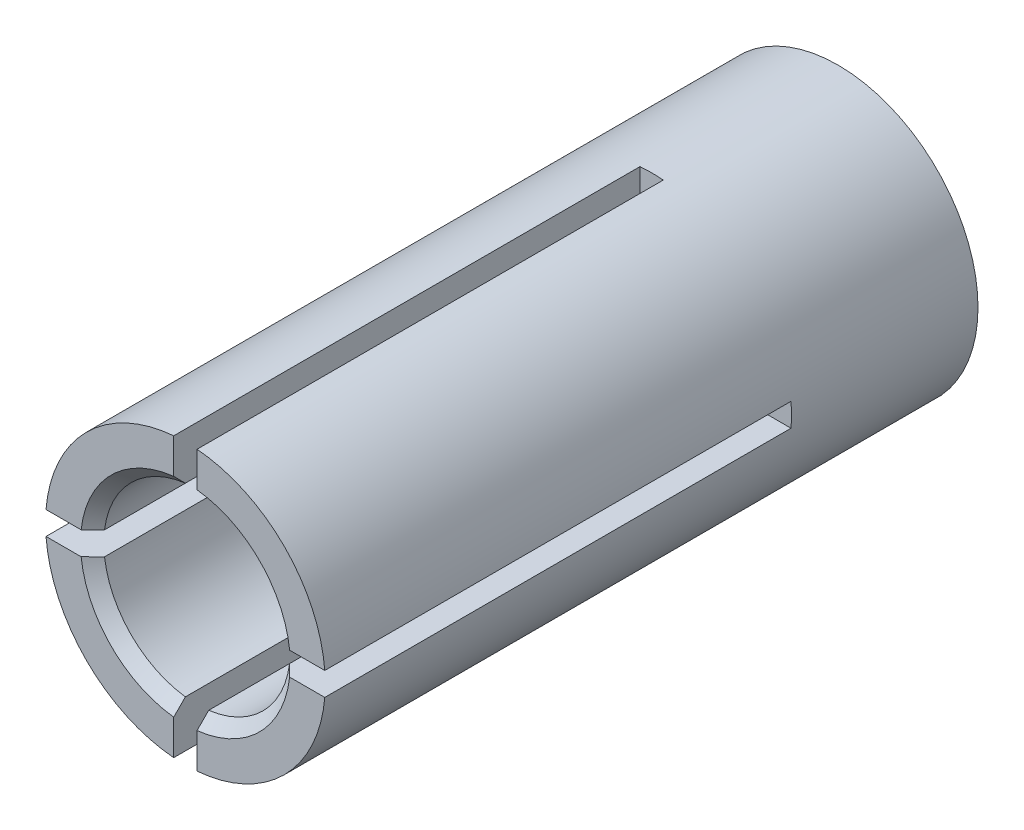
ISO-10303-21;
HEADER;
FILE_DESCRIPTION(('STEP AP214'),'2;1');
FILE_NAME('part.step','',(''),(''),'','','');
FILE_SCHEMA(('AUTOMOTIVE_DESIGN { 1 0 10303 214 1 1 1 1 }'));
ENDSEC;
DATA;
#1=APPLICATION_CONTEXT('core data for automotive mechanical design processes');
#2=APPLICATION_PROTOCOL_DEFINITION('international standard','automotive_design',2000,#1);
#3=PRODUCT_CONTEXT('',#1,'mechanical');
#4=PRODUCT('Part','Part','',(#3));
#5=PRODUCT_RELATED_PRODUCT_CATEGORY('part','',(#4));
#6=PRODUCT_DEFINITION_FORMATION('','',#4);
#7=PRODUCT_DEFINITION_CONTEXT('part definition',#1,'design');
#8=PRODUCT_DEFINITION('design','',#6,#7);
#9=PRODUCT_DEFINITION_SHAPE('','',#8);
#10=(LENGTH_UNIT() NAMED_UNIT(*) SI_UNIT(.MILLI.,.METRE.));
#11=(NAMED_UNIT(*) PLANE_ANGLE_UNIT() SI_UNIT($,.RADIAN.));
#12=(NAMED_UNIT(*) SI_UNIT($,.STERADIAN.) SOLID_ANGLE_UNIT());
#13=UNCERTAINTY_MEASURE_WITH_UNIT(LENGTH_MEASURE(1.E-05),#10,'distance_accuracy_value','');
#14=(GEOMETRIC_REPRESENTATION_CONTEXT(3) GLOBAL_UNCERTAINTY_ASSIGNED_CONTEXT((#13)) GLOBAL_UNIT_ASSIGNED_CONTEXT((#10,
#11,#12)) REPRESENTATION_CONTEXT('',''));
#15=CARTESIAN_POINT('',(0.,0.,0.));
#16=DIRECTION('',(0.,0.,1.));
#17=DIRECTION('',(1.,0.,0.));
#18=AXIS2_PLACEMENT_3D('',#15,#16,#17);
#19=CARTESIAN_POINT('',(0.,0.,14.));
#20=DIRECTION('',(0.,0.,1.));
#21=DIRECTION('',(1.,0.,0.));
#22=AXIS2_PLACEMENT_3D('',#19,#20,#21);
#23=PLANE('',#22);
#24=DIRECTION('',(1.,0.,0.));
#25=VECTOR('',#24,1.);
#26=CARTESIAN_POINT('',(2.98956518577535,-0.25,14.));
#27=LINE('',#26,#25);
#28=CARTESIAN_POINT('',(2.23606797749979,-0.25,14.));
#29=VERTEX_POINT('',#28);
#30=CARTESIAN_POINT('',(2.98956518577535,-0.25,14.));
#31=VERTEX_POINT('',#30);
#32=EDGE_CURVE('E192',#29,#31,#27,.T.);
#33=ORIENTED_EDGE('',*,*,#32,.F.);
#34=CARTESIAN_POINT('',(0.,0.,14.));
#35=DIRECTION('',(0.,0.,1.));
#36=DIRECTION('',(1.,0.,0.));
#37=AXIS2_PLACEMENT_3D('',#34,#35,#36);
#38=CIRCLE('',#37,2.25);
#39=CARTESIAN_POINT('',(0.25,-2.23606797749979,14.));
#40=VERTEX_POINT('',#39);
#41=EDGE_CURVE('E238',#29,#40,#38,.F.);
#42=ORIENTED_EDGE('',*,*,#41,.T.);
#43=DIRECTION('',(0.,1.,0.));
#44=VECTOR('',#43,1.);
#45=CARTESIAN_POINT('',(0.25,-0.25,14.));
#46=LINE('',#45,#44);
#47=CARTESIAN_POINT('',(0.250000000000002,-2.98956518577535,14.));
#48=VERTEX_POINT('',#47);
#49=EDGE_CURVE('E290',#48,#40,#46,.T.);
#50=ORIENTED_EDGE('',*,*,#49,.F.);
#51=CARTESIAN_POINT('',(0.,0.,14.));
#52=DIRECTION('',(0.,0.,1.));
#53=DIRECTION('',(1.,0.,0.));
#54=AXIS2_PLACEMENT_3D('',#51,#52,#53);
#55=CIRCLE('',#54,3.);
#56=EDGE_CURVE('E230',#48,#31,#55,.T.);
#57=ORIENTED_EDGE('',*,*,#56,.T.);
#58=EDGE_LOOP('',(#33,#42,#50,#57));
#59=FACE_BOUND('',#58,.T.);
#60=ADVANCED_FACE('F33',(#59),#23,.T.);
#61=DIRECTION('',(0.,-1.,0.));
#62=VECTOR('',#61,1.);
#63=CARTESIAN_POINT('',(-0.25,-0.25,14.));
#64=LINE('',#63,#62);
#65=CARTESIAN_POINT('',(-0.25,-2.23606797749979,14.));
#66=VERTEX_POINT('',#65);
#67=CARTESIAN_POINT('',(-0.25,-2.98956518577535,14.));
#68=VERTEX_POINT('',#67);
#69=EDGE_CURVE('E397',#66,#68,#64,.T.);
#70=ORIENTED_EDGE('',*,*,#69,.F.);
#71=CARTESIAN_POINT('',(-2.23606797749979,-0.25,14.));
#72=VERTEX_POINT('',#71);
#73=EDGE_CURVE('E242',#66,#72,#38,.F.);
#74=ORIENTED_EDGE('',*,*,#73,.T.);
#75=DIRECTION('',(1.,0.,0.));
#76=VECTOR('',#75,1.);
#77=CARTESIAN_POINT('',(-2.98956518577535,-0.25,14.));
#78=LINE('',#77,#76);
#79=CARTESIAN_POINT('',(-2.98956518577535,-0.249999999999999,14.));
#80=VERTEX_POINT('',#79);
#81=EDGE_CURVE('E395',#80,#72,#78,.T.);
#82=ORIENTED_EDGE('',*,*,#81,.F.);
#83=EDGE_CURVE('E437',#80,#68,#55,.T.);
#84=ORIENTED_EDGE('',*,*,#83,.T.);
#85=EDGE_LOOP('',(#70,#74,#82,#84));
#86=FACE_BOUND('',#85,.T.);
#87=ADVANCED_FACE('F278',(#86),#23,.T.);
#88=DIRECTION('',(-1.,0.,0.));
#89=VECTOR('',#88,1.);
#90=CARTESIAN_POINT('',(-2.98956518577535,0.249999999999998,14.));
#91=LINE('',#90,#89);
#92=CARTESIAN_POINT('',(-2.23606797749979,0.249999999999999,14.));
#93=VERTEX_POINT('',#92);
#94=CARTESIAN_POINT('',(-2.98956518577535,0.249999999999998,14.));
#95=VERTEX_POINT('',#94);
#96=EDGE_CURVE('E415',#93,#95,#91,.T.);
#97=ORIENTED_EDGE('',*,*,#96,.F.);
#98=CARTESIAN_POINT('',(-0.25,2.23606797749979,14.));
#99=VERTEX_POINT('',#98);
#100=EDGE_CURVE('E384',#93,#99,#38,.F.);
#101=ORIENTED_EDGE('',*,*,#100,.T.);
#102=DIRECTION('',(0.,-1.,0.));
#103=VECTOR('',#102,1.);
#104=CARTESIAN_POINT('',(-0.25,0.25,14.));
#105=LINE('',#104,#103);
#106=CARTESIAN_POINT('',(-0.25,2.98956518577535,14.));
#107=VERTEX_POINT('',#106);
#108=EDGE_CURVE('E418',#107,#99,#105,.T.);
#109=ORIENTED_EDGE('',*,*,#108,.F.);
#110=EDGE_CURVE('E229',#107,#95,#55,.T.);
#111=ORIENTED_EDGE('',*,*,#110,.T.);
#112=EDGE_LOOP('',(#97,#101,#109,#111));
#113=FACE_BOUND('',#112,.T.);
#114=ADVANCED_FACE('F271',(#113),#23,.T.);
#115=CARTESIAN_POINT('',(0.,0.,13.75));
#116=DIRECTION('',(0.,0.,1.));
#117=DIRECTION('',(1.,0.,0.));
#118=AXIS2_PLACEMENT_3D('',#115,#116,#117);
#119=CONICAL_SURFACE('',#118,2.,0.785398163397455);
#120=CARTESIAN_POINT('',(0.302741084224424,-0.25,12.1426221645264));
#121=CARTESIAN_POINT('',(0.317960453729847,-0.25,12.1543679730482));
#122=CARTESIAN_POINT('',(0.333014531848367,-0.25,12.1663229463904));
#123=CARTESIAN_POINT('',(0.36285792672978,-0.25,12.190554220147));
#124=CARTESIAN_POINT('',(0.377647290102898,-0.25,12.2028304630369));
#125=CARTESIAN_POINT('',(0.421711584192529,-0.25,12.2399907180696));
#126=CARTESIAN_POINT('',(0.450696505860516,-0.25,12.2652171671053));
#127=CARTESIAN_POINT('',(0.508176291730957,-0.25,12.3161879557759));
#128=CARTESIAN_POINT('',(0.5366714023152,-0.25,12.3419320200088));
#129=CARTESIAN_POINT('',(0.593351685196752,-0.25,12.3937670443241));
#130=CARTESIAN_POINT('',(0.621536809723744,-0.25,12.4198580565411));
#131=CARTESIAN_POINT('',(0.709452963884151,-0.25,12.5018997394878));
#132=CARTESIAN_POINT('',(0.768811177280419,-0.25,12.5582489591398));
#133=CARTESIAN_POINT('',(0.887045822918403,-0.25,12.6714511318724));
#134=CARTESIAN_POINT('',(0.945922240026668,-0.25,12.72830410066));
#135=CARTESIAN_POINT('',(1.12213731279967,-0.25,12.8992872007103));
#136=CARTESIAN_POINT('',(1.23906296186066,-0.25,13.013842641041));
#137=CARTESIAN_POINT('',(1.47257646545155,-0.25,13.2435090676362));
#138=CARTESIAN_POINT('',(1.58916391117353,-0.25,13.3586204674635));
#139=CARTESIAN_POINT('',(1.82209400881993,-0.25,13.5890861029974));
#140=CARTESIAN_POINT('',(1.9384366657381,-0.25,13.7044403336521));
#141=CARTESIAN_POINT('',(2.19822193413989,-0.25,13.9623251721432));
#142=CARTESIAN_POINT('',(2.34162858752974,-0.25,14.104891962737));
#143=CARTESIAN_POINT('',(2.62832290392371,-0.25,14.3901473591601));
#144=CARTESIAN_POINT('',(2.77161056599507,-0.25,14.5328359659267));
#145=CARTESIAN_POINT('',(3.05792402957366,-0.25,14.8181018736583));
#146=CARTESIAN_POINT('',(3.20094992869957,-0.25,14.9606790766729));
#147=CARTESIAN_POINT('',(3.48694883303794,-0.25,15.2458841152313));
#148=CARTESIAN_POINT('',(3.6299218386862,-0.25,15.3885119503382));
#149=CARTESIAN_POINT('',(3.77288046266891,-0.25,15.5311541869631));
#150=B_SPLINE_CURVE_WITH_KNOTS('',3,(#120,#121,#122,#123,#124,#125,#126,#127,#128,#129,#130,
#131,#132,#133,#134,#135,#136,#137,#138,#139,#140,#141,#142,#143,#144,#145,#146,#147,#148,#149),
.UNSPECIFIED.,.F.,.F.,(4,2,2,2,2,2,2,2,2,2,2,2,2,2,4),(0.,0.0576681378172349,0.115326019670359,
0.23058906804333,0.345792332639199,0.461013108618342,0.706541151172434,0.952076876502175,
1.44314347376522,1.93466102702139,2.42616845403975,3.03281229507879,3.63946084754579,
4.24531725391537,4.85116855206024),.UNSPECIFIED.);
#151=CARTESIAN_POINT('',(1.98431348329844,-0.25,13.75));
#152=VERTEX_POINT('',#151);
#153=EDGE_CURVE('E297',#152,#29,#150,.T.);
#154=ORIENTED_EDGE('',*,*,#153,.F.);
#155=CARTESIAN_POINT('',(0.,0.,13.75));
#156=DIRECTION('',(0.,0.,1.));
#157=DIRECTION('',(1.,0.,0.));
#158=AXIS2_PLACEMENT_3D('',#155,#156,#157);
#159=CIRCLE('',#158,2.);
#160=CARTESIAN_POINT('',(0.25,-1.98431348329844,13.75));
#161=VERTEX_POINT('',#160);
#162=EDGE_CURVE('E228',#161,#152,#159,.T.);
#163=ORIENTED_EDGE('',*,*,#162,.F.);
#164=CARTESIAN_POINT('',(0.25,-3.77288046266891,15.5311541869631));
#165=CARTESIAN_POINT('',(0.25,-3.62981802243947,15.3884085007871));
#166=CARTESIAN_POINT('',(0.25,-3.48674127796846,15.245677131242));
#167=CARTESIAN_POINT('',(0.25,-3.20054113992748,14.9602714322271));
#168=CARTESIAN_POINT('',(0.25,-3.05741774821332,14.8175971008963));
#169=CARTESIAN_POINT('',(0.25,-2.77111016330189,14.5323377376306));
#170=CARTESIAN_POINT('',(0.25,-2.62792597750641,14.3897526982675));
#171=CARTESIAN_POINT('',(0.25,-2.34143336691177,14.1046974507362));
#172=CARTESIAN_POINT('',(0.25,-2.19812493795967,13.9622272467398));
#173=CARTESIAN_POINT('',(0.25,-1.98298880509478,13.7486673764058));
#174=CARTESIAN_POINT('',(0.25,-1.91124050811756,13.6774977298582));
#175=CARTESIAN_POINT('',(0.25,-1.76767011833127,13.5352348752943));
#176=CARTESIAN_POINT('',(0.25,-1.69584802655194,13.464141666239));
#177=CARTESIAN_POINT('',(0.25,-1.55210436650431,13.3220711612731));
#178=CARTESIAN_POINT('',(0.25,-1.48018280965929,13.2510938538114));
#179=CARTESIAN_POINT('',(0.25,-1.33617309257203,13.1093013228982));
#180=CARTESIAN_POINT('',(0.25,-1.2640849242968,13.0384861076038));
#181=CARTESIAN_POINT('',(0.25,-1.11962163137609,12.8970953300996));
#182=CARTESIAN_POINT('',(0.25,-1.04724641128778,12.8265198651804));
#183=CARTESIAN_POINT('',(0.25,-0.938335808618407,12.7210277003167));
#184=CARTESIAN_POINT('',(0.25,-0.90197738080137,12.6859284166719));
#185=CARTESIAN_POINT('',(0.25,-0.829090459358274,12.6159028370612));
#186=CARTESIAN_POINT('',(0.25,-0.792561957067124,12.5809765501007));
#187=CARTESIAN_POINT('',(0.25,-0.719238707395647,12.5113617459312));
#188=CARTESIAN_POINT('',(0.25,-0.682443818330706,12.4766733778196));
#189=CARTESIAN_POINT('',(0.25,-0.608484016046663,12.4077018126905));
#190=CARTESIAN_POINT('',(0.25,-0.57131915658067,12.3734185583522));
#191=CARTESIAN_POINT('',(0.25,-0.51508999379516,12.3224993377492));
#192=CARTESIAN_POINT('',(0.25,-0.496260183651158,12.3056049183895));
#193=CARTESIAN_POINT('',(0.25,-0.458389334451682,12.2720572281331));
#194=CARTESIAN_POINT('',(0.25,-0.439348311762073,12.2554039387796));
#195=CARTESIAN_POINT('',(0.25,-0.400970972219268,12.2224183848648));
#196=CARTESIAN_POINT('',(0.25,-0.381634510005532,12.206086288006));
#197=CARTESIAN_POINT('',(0.25,-0.342537743825695,12.1739281736697));
#198=CARTESIAN_POINT('',(0.25,-0.32277732694518,12.1581022938832));
#199=CARTESIAN_POINT('',(0.25,-0.302741084224424,12.1426221645264));
#200=B_SPLINE_CURVE_WITH_KNOTS('',3,(#164,#165,#166,#167,#168,#169,#170,#171,#172,#173,#174,
#175,#176,#177,#178,#179,#180,#181,#182,#183,#184,#185,#186,#187,#188,#189,#190,#191,#192,#193,
#194,#195,#196,#197,#198,#199),.UNSPECIFIED.,.F.,.F.,(4,2,2,2,2,2,2,2,2,2,2,2,2,2,2,2,2,4),(0.,
0.606290986171906,1.21256024144211,1.81876961421285,2.42500009807164,2.72817728399238,
3.03135029532569,3.33449098070736,3.63764660000146,3.94091326932693,4.09252113778145,
4.24413681689769,4.39584012888943,4.5475217125328,4.62341380562543,4.69930005871457,
4.77522493487536,4.85117028995729),.UNSPECIFIED.);
#201=EDGE_CURVE('E299',#40,#161,#200,.T.);
#202=ORIENTED_EDGE('',*,*,#201,.F.);
#203=ORIENTED_EDGE('',*,*,#41,.F.);
#204=EDGE_LOOP('',(#154,#163,#202,#203));
#205=FACE_BOUND('',#204,.T.);
#206=ADVANCED_FACE('F295',(#205),#119,.F.);
#207=CARTESIAN_POINT('',(-0.25,-0.302741084224424,12.1426221645264));
#208=CARTESIAN_POINT('',(-0.25,-0.317960453729847,12.1543679730482));
#209=CARTESIAN_POINT('',(-0.25,-0.333014531848367,12.1663229463904));
#210=CARTESIAN_POINT('',(-0.25,-0.36285792672978,12.190554220147));
#211=CARTESIAN_POINT('',(-0.25,-0.377647290102898,12.2028304630369));
#212=CARTESIAN_POINT('',(-0.25,-0.421711584192529,12.2399907180696));
#213=CARTESIAN_POINT('',(-0.25,-0.450696505860515,12.2652171671053));
#214=CARTESIAN_POINT('',(-0.25,-0.508176291730958,12.3161879557759));
#215=CARTESIAN_POINT('',(-0.25,-0.536671402315201,12.3419320200088));
#216=CARTESIAN_POINT('',(-0.25,-0.593351685196753,12.3937670443241));
#217=CARTESIAN_POINT('',(-0.25,-0.621536809723744,12.4198580565411));
#218=CARTESIAN_POINT('',(-0.25,-0.70945296388415,12.5018997394878));
#219=CARTESIAN_POINT('',(-0.25,-0.768811177280418,12.5582489591398));
#220=CARTESIAN_POINT('',(-0.25,-0.887045822918402,12.6714511318724));
#221=CARTESIAN_POINT('',(-0.25,-0.945922240026668,12.72830410066));
#222=CARTESIAN_POINT('',(-0.25,-1.12213731279967,12.8992872007103));
#223=CARTESIAN_POINT('',(-0.25,-1.23906296186066,13.013842641041));
#224=CARTESIAN_POINT('',(-0.25,-1.47257646545154,13.2435090676362));
#225=CARTESIAN_POINT('',(-0.25,-1.58916391117353,13.3586204674635));
#226=CARTESIAN_POINT('',(-0.25,-1.82209400881993,13.5890861029974));
#227=CARTESIAN_POINT('',(-0.25,-1.9384366657381,13.7044403336521));
#228=CARTESIAN_POINT('',(-0.25,-2.19822193413989,13.9623251721432));
#229=CARTESIAN_POINT('',(-0.25,-2.34162858752974,14.104891962737));
#230=CARTESIAN_POINT('',(-0.25,-2.62832290392371,14.3901473591601));
#231=CARTESIAN_POINT('',(-0.25,-2.77161056599507,14.5328359659267));
#232=CARTESIAN_POINT('',(-0.25,-3.05792402957366,14.8181018736583));
#233=CARTESIAN_POINT('',(-0.25,-3.20094992869957,14.9606790766729));
#234=CARTESIAN_POINT('',(-0.25,-3.48694883303794,15.2458841152313));
#235=CARTESIAN_POINT('',(-0.25,-3.6299218386862,15.3885119503382));
#236=CARTESIAN_POINT('',(-0.25,-3.77288046266891,15.5311541869631));
#237=B_SPLINE_CURVE_WITH_KNOTS('',3,(#207,#208,#209,#210,#211,#212,#213,#214,#215,#216,#217,
#218,#219,#220,#221,#222,#223,#224,#225,#226,#227,#228,#229,#230,#231,#232,#233,#234,#235,#236),
.UNSPECIFIED.,.F.,.F.,(4,2,2,2,2,2,2,2,2,2,2,2,2,2,4),(0.,0.0576681378172349,0.115326019670359,
0.23058906804333,0.345792332639199,0.461013108618342,0.706541151172433,0.952076876502175,
1.44314347376522,1.93466102702139,2.42616845403975,3.03281229507879,3.63946084754579,
4.24531725391537,4.85116855206024),.UNSPECIFIED.);
#238=CARTESIAN_POINT('',(-0.25,-1.98431348329844,13.75));
#239=VERTEX_POINT('',#238);
#240=EDGE_CURVE('E302',#239,#66,#237,.T.);
#241=ORIENTED_EDGE('',*,*,#240,.F.);
#242=CARTESIAN_POINT('',(-1.98431348329844,-0.25,13.75));
#243=VERTEX_POINT('',#242);
#244=EDGE_CURVE('E403',#243,#239,#159,.T.);
#245=ORIENTED_EDGE('',*,*,#244,.F.);
#246=CARTESIAN_POINT('',(-3.77288046266891,-0.25,15.5311541869631));
#247=CARTESIAN_POINT('',(-3.62981802243947,-0.25,15.3884085007871));
#248=CARTESIAN_POINT('',(-3.48674127796846,-0.25,15.245677131242));
#249=CARTESIAN_POINT('',(-3.20054113992748,-0.25,14.9602714322271));
#250=CARTESIAN_POINT('',(-3.05741774821332,-0.25,14.8175971008962));
#251=CARTESIAN_POINT('',(-2.77111016330189,-0.25,14.5323377376306));
#252=CARTESIAN_POINT('',(-2.6279259775064,-0.25,14.3897526982675));
#253=CARTESIAN_POINT('',(-2.34143336691176,-0.25,14.1046974507362));
#254=CARTESIAN_POINT('',(-2.19812493795967,-0.25,13.9622272467398));
#255=CARTESIAN_POINT('',(-1.98298880509478,-0.25,13.7486673764058));
#256=CARTESIAN_POINT('',(-1.91124050811756,-0.25,13.6774977298582));
#257=CARTESIAN_POINT('',(-1.76767011833127,-0.25,13.5352348752943));
#258=CARTESIAN_POINT('',(-1.69584802655194,-0.25,13.464141666239));
#259=CARTESIAN_POINT('',(-1.55210436650431,-0.25,13.3220711612731));
#260=CARTESIAN_POINT('',(-1.48018280965929,-0.25,13.2510938538114));
#261=CARTESIAN_POINT('',(-1.33617309257203,-0.25,13.1093013228982));
#262=CARTESIAN_POINT('',(-1.2640849242968,-0.25,13.0384861076038));
#263=CARTESIAN_POINT('',(-1.11962163137609,-0.25,12.8970953300996));
#264=CARTESIAN_POINT('',(-1.04724641128778,-0.25,12.8265198651804));
#265=CARTESIAN_POINT('',(-0.938335808618407,-0.25,12.7210277003167));
#266=CARTESIAN_POINT('',(-0.901977380801369,-0.25,12.6859284166719));
#267=CARTESIAN_POINT('',(-0.829090459358274,-0.25,12.6159028370612));
#268=CARTESIAN_POINT('',(-0.792561957067124,-0.25,12.5809765501007));
#269=CARTESIAN_POINT('',(-0.719238707395648,-0.25,12.5113617459312));
#270=CARTESIAN_POINT('',(-0.682443818330707,-0.25,12.4766733778196));
#271=CARTESIAN_POINT('',(-0.608484016046665,-0.25,12.4077018126905));
#272=CARTESIAN_POINT('',(-0.571319156580671,-0.25,12.3734185583522));
#273=CARTESIAN_POINT('',(-0.515089993795162,-0.25,12.3224993377492));
#274=CARTESIAN_POINT('',(-0.496260183651158,-0.25,12.3056049183895));
#275=CARTESIAN_POINT('',(-0.458389334451683,-0.25,12.2720572281331));
#276=CARTESIAN_POINT('',(-0.439348311762074,-0.25,12.2554039387796));
#277=CARTESIAN_POINT('',(-0.40097097221927,-0.25,12.2224183848648));
#278=CARTESIAN_POINT('',(-0.381634510005534,-0.25,12.2060862880061));
#279=CARTESIAN_POINT('',(-0.342537743825697,-0.25,12.1739281736697));
#280=CARTESIAN_POINT('',(-0.322777326945181,-0.25,12.1581022938832));
#281=CARTESIAN_POINT('',(-0.302741084224424,-0.25,12.1426221645264));
#282=B_SPLINE_CURVE_WITH_KNOTS('',3,(#246,#247,#248,#249,#250,#251,#252,#253,#254,#255,#256,
#257,#258,#259,#260,#261,#262,#263,#264,#265,#266,#267,#268,#269,#270,#271,#272,#273,#274,#275,
#276,#277,#278,#279,#280,#281),.UNSPECIFIED.,.F.,.F.,(4,2,2,2,2,2,2,2,2,2,2,2,2,2,2,2,2,4),(0.,
0.606290986171907,1.21256024144211,1.81876961421285,2.42500009807164,2.72817728399238,
3.03135029532568,3.33449098070736,3.63764660000146,3.94091326932692,4.09252113778145,
4.24413681689769,4.39584012888943,4.54752171253279,4.62341380562543,4.69930005871457,
4.77522493487535,4.85117028995728),.UNSPECIFIED.);
#283=EDGE_CURVE('E304',#72,#243,#282,.T.);
#284=ORIENTED_EDGE('',*,*,#283,.F.);
#285=ORIENTED_EDGE('',*,*,#73,.F.);
#286=EDGE_LOOP('',(#241,#245,#284,#285));
#287=FACE_BOUND('',#286,.T.);
#288=ADVANCED_FACE('F400',(#287),#119,.F.);
#289=CARTESIAN_POINT('',(-0.302741084224424,0.25,12.1426221645264));
#290=CARTESIAN_POINT('',(-0.317960453729848,0.25,12.1543679730482));
#291=CARTESIAN_POINT('',(-0.333014531848367,0.25,12.1663229463904));
#292=CARTESIAN_POINT('',(-0.362857926729781,0.25,12.190554220147));
#293=CARTESIAN_POINT('',(-0.3776472901029,0.25,12.2028304630369));
#294=CARTESIAN_POINT('',(-0.42171158419253,0.25,12.2399907180696));
#295=CARTESIAN_POINT('',(-0.450696505860517,0.25,12.2652171671053));
#296=CARTESIAN_POINT('',(-0.508176291730959,0.25,12.3161879557759));
#297=CARTESIAN_POINT('',(-0.536671402315202,0.25,12.3419320200088));
#298=CARTESIAN_POINT('',(-0.593351685196754,0.25,12.3937670443241));
#299=CARTESIAN_POINT('',(-0.621536809723745,0.25,12.4198580565411));
#300=CARTESIAN_POINT('',(-0.709452963884151,0.25,12.5018997394878));
#301=CARTESIAN_POINT('',(-0.768811177280419,0.25,12.5582489591398));
#302=CARTESIAN_POINT('',(-0.887045822918403,0.249999999999999,12.6714511318724));
#303=CARTESIAN_POINT('',(-0.945922240026669,0.249999999999999,12.72830410066));
#304=CARTESIAN_POINT('',(-1.12213731279967,0.249999999999999,12.8992872007103));
#305=CARTESIAN_POINT('',(-1.23906296186066,0.249999999999999,13.013842641041));
#306=CARTESIAN_POINT('',(-1.47257646545154,0.249999999999999,13.2435090676362));
#307=CARTESIAN_POINT('',(-1.58916391117353,0.249999999999999,13.3586204674635));
#308=CARTESIAN_POINT('',(-1.82209400881993,0.249999999999999,13.5890861029974));
#309=CARTESIAN_POINT('',(-1.9384366657381,0.249999999999999,13.7044403336521));
#310=CARTESIAN_POINT('',(-2.19822193413989,0.249999999999999,13.9623251721432));
#311=CARTESIAN_POINT('',(-2.34162858752973,0.249999999999999,14.104891962737));
#312=CARTESIAN_POINT('',(-2.62832290392371,0.249999999999998,14.3901473591601));
#313=CARTESIAN_POINT('',(-2.77161056599507,0.249999999999998,14.5328359659267));
#314=CARTESIAN_POINT('',(-3.05792402957366,0.249999999999998,14.8181018736583));
#315=CARTESIAN_POINT('',(-3.20094992869957,0.249999999999998,14.9606790766729));
#316=CARTESIAN_POINT('',(-3.48694883303793,0.249999999999998,15.2458841152313));
#317=CARTESIAN_POINT('',(-3.6299218386862,0.249999999999998,15.3885119503382));
#318=CARTESIAN_POINT('',(-3.77288046266891,0.249999999999998,15.5311541869631));
#319=B_SPLINE_CURVE_WITH_KNOTS('',3,(#289,#290,#291,#292,#293,#294,#295,#296,#297,#298,#299,
#300,#301,#302,#303,#304,#305,#306,#307,#308,#309,#310,#311,#312,#313,#314,#315,#316,#317,#318),
.UNSPECIFIED.,.F.,.F.,(4,2,2,2,2,2,2,2,2,2,2,2,2,2,4),(0.,0.0576681378172349,0.115326019670361,
0.230589068043331,0.345792332639199,0.461013108618343,0.706541151172433,0.952076876502175,
1.44314347376522,1.93466102702138,2.42616845403975,3.03281229507879,3.63946084754578,
4.24531725391537,4.85116855206023),.UNSPECIFIED.);
#320=CARTESIAN_POINT('',(-1.98431348329844,0.249999999999999,13.75));
#321=VERTEX_POINT('',#320);
#322=EDGE_CURVE('E341',#321,#93,#319,.T.);
#323=ORIENTED_EDGE('',*,*,#322,.F.);
#324=CARTESIAN_POINT('',(-0.25,1.98431348329844,13.75));
#325=VERTEX_POINT('',#324);
#326=EDGE_CURVE('E237',#325,#321,#159,.T.);
#327=ORIENTED_EDGE('',*,*,#326,.F.);
#328=CARTESIAN_POINT('',(-0.25,3.77288046266891,15.5311541869631));
#329=CARTESIAN_POINT('',(-0.25,3.62981802243947,15.3884085007871));
#330=CARTESIAN_POINT('',(-0.25,3.48674127796846,15.245677131242));
#331=CARTESIAN_POINT('',(-0.25,3.20054113992748,14.9602714322271));
#332=CARTESIAN_POINT('',(-0.25,3.05741774821332,14.8175971008962));
#333=CARTESIAN_POINT('',(-0.25,2.77111016330189,14.5323377376306));
#334=CARTESIAN_POINT('',(-0.25,2.6279259775064,14.3897526982675));
#335=CARTESIAN_POINT('',(-0.25,2.34143336691176,14.1046974507362));
#336=CARTESIAN_POINT('',(-0.25,2.19812493795967,13.9622272467398));
#337=CARTESIAN_POINT('',(-0.25,1.98298880509478,13.7486673764058));
#338=CARTESIAN_POINT('',(-0.25,1.91124050811756,13.6774977298582));
#339=CARTESIAN_POINT('',(-0.25,1.76767011833127,13.5352348752943));
#340=CARTESIAN_POINT('',(-0.25,1.69584802655194,13.464141666239));
#341=CARTESIAN_POINT('',(-0.25,1.55210436650431,13.3220711612731));
#342=CARTESIAN_POINT('',(-0.25,1.48018280965929,13.2510938538114));
#343=CARTESIAN_POINT('',(-0.25,1.33617309257203,13.1093013228982));
#344=CARTESIAN_POINT('',(-0.25,1.2640849242968,13.0384861076038));
#345=CARTESIAN_POINT('',(-0.25,1.11962163137609,12.8970953300996));
#346=CARTESIAN_POINT('',(-0.25,1.04724641128778,12.8265198651804));
#347=CARTESIAN_POINT('',(-0.25,0.938335808618407,12.7210277003167));
#348=CARTESIAN_POINT('',(-0.25,0.901977380801369,12.6859284166719));
#349=CARTESIAN_POINT('',(-0.25,0.829090459358274,12.6159028370612));
#350=CARTESIAN_POINT('',(-0.25,0.792561957067124,12.5809765501007));
#351=CARTESIAN_POINT('',(-0.25,0.719238707395648,12.5113617459312));
#352=CARTESIAN_POINT('',(-0.25,0.682443818330707,12.4766733778196));
#353=CARTESIAN_POINT('',(-0.25,0.608484016046665,12.4077018126905));
#354=CARTESIAN_POINT('',(-0.25,0.571319156580672,12.3734185583522));
#355=CARTESIAN_POINT('',(-0.25,0.515089993795162,12.3224993377492));
#356=CARTESIAN_POINT('',(-0.25,0.496260183651158,12.3056049183895));
#357=CARTESIAN_POINT('',(-0.25,0.458389334451682,12.2720572281331));
#358=CARTESIAN_POINT('',(-0.25,0.439348311762074,12.2554039387796));
#359=CARTESIAN_POINT('',(-0.25,0.40097097221927,12.2224183848648));
#360=CARTESIAN_POINT('',(-0.25,0.381634510005534,12.2060862880061));
#361=CARTESIAN_POINT('',(-0.25,0.342537743825697,12.1739281736697));
#362=CARTESIAN_POINT('',(-0.25,0.322777326945181,12.1581022938832));
#363=CARTESIAN_POINT('',(-0.25,0.302741084224424,12.1426221645264));
#364=B_SPLINE_CURVE_WITH_KNOTS('',3,(#328,#329,#330,#331,#332,#333,#334,#335,#336,#337,#338,
#339,#340,#341,#342,#343,#344,#345,#346,#347,#348,#349,#350,#351,#352,#353,#354,#355,#356,#357,
#358,#359,#360,#361,#362,#363),.UNSPECIFIED.,.F.,.F.,(4,2,2,2,2,2,2,2,2,2,2,2,2,2,2,2,2,4),(0.,
0.606290986171907,1.21256024144211,1.81876961421285,2.42500009807164,2.72817728399238,
3.03135029532568,3.33449098070736,3.63764660000146,3.94091326932692,4.09252113778145,
4.24413681689769,4.39584012888943,4.54752171253279,4.62341380562542,4.69930005871457,
4.77522493487536,4.85117028995728),.UNSPECIFIED.);
#365=EDGE_CURVE('E345',#99,#325,#364,.T.);
#366=ORIENTED_EDGE('',*,*,#365,.F.);
#367=ORIENTED_EDGE('',*,*,#100,.F.);
#368=EDGE_LOOP('',(#323,#327,#366,#367));
#369=FACE_BOUND('',#368,.T.);
#370=ADVANCED_FACE('F269',(#369),#119,.F.);
#371=DIRECTION('',(0.,1.,0.));
#372=VECTOR('',#371,1.);
#373=CARTESIAN_POINT('',(0.25,2.98956518577535,14.));
#374=LINE('',#373,#372);
#375=CARTESIAN_POINT('',(0.25,2.23606797749979,14.));
#376=VERTEX_POINT('',#375);
#377=CARTESIAN_POINT('',(0.25,2.98956518577535,14.));
#378=VERTEX_POINT('',#377);
#379=EDGE_CURVE('E421',#376,#378,#374,.T.);
#380=ORIENTED_EDGE('',*,*,#379,.F.);
#381=CARTESIAN_POINT('',(2.23606797749979,0.25,14.));
#382=VERTEX_POINT('',#381);
#383=EDGE_CURVE('E236',#376,#382,#38,.F.);
#384=ORIENTED_EDGE('',*,*,#383,.T.);
#385=DIRECTION('',(-1.,0.,0.));
#386=VECTOR('',#385,1.);
#387=CARTESIAN_POINT('',(0.25,0.25,14.));
#388=LINE('',#387,#386);
#389=CARTESIAN_POINT('',(2.98956518577535,0.25,14.));
#390=VERTEX_POINT('',#389);
#391=EDGE_CURVE('E453',#390,#382,#388,.T.);
#392=ORIENTED_EDGE('',*,*,#391,.F.);
#393=EDGE_CURVE('E200',#390,#378,#55,.T.);
#394=ORIENTED_EDGE('',*,*,#393,.T.);
#395=EDGE_LOOP('',(#380,#384,#392,#394));
#396=FACE_BOUND('',#395,.T.);
#397=ADVANCED_FACE('F265',(#396),#23,.T.);
#398=CARTESIAN_POINT('',(0.,0.,0.));
#399=DIRECTION('',(0.,0.,1.));
#400=DIRECTION('',(1.,0.,0.));
#401=AXIS2_PLACEMENT_3D('',#398,#399,#400);
#402=PLANE('',#401);
#403=CARTESIAN_POINT('',(0.,0.,0.));
#404=DIRECTION('',(0.,0.,1.));
#405=DIRECTION('',(1.,0.,0.));
#406=AXIS2_PLACEMENT_3D('',#403,#404,#405);
#407=CIRCLE('',#406,3.);
#408=CARTESIAN_POINT('',(3.,0.,0.));
#409=VERTEX_POINT('',#408);
#410=EDGE_CURVE('E226',#409,#409,#407,.T.);
#411=ORIENTED_EDGE('',*,*,#410,.F.);
#412=EDGE_LOOP('',(#411));
#413=FACE_BOUND('',#412,.T.);
#414=CARTESIAN_POINT('',(0.,0.,0.));
#415=DIRECTION('',(0.,0.,1.));
#416=DIRECTION('',(1.,0.,0.));
#417=AXIS2_PLACEMENT_3D('',#414,#415,#416);
#418=CIRCLE('',#417,2.);
#419=CARTESIAN_POINT('',(2.,0.,0.));
#420=VERTEX_POINT('',#419);
#421=EDGE_CURVE('E223',#420,#420,#418,.T.);
#422=ORIENTED_EDGE('',*,*,#421,.T.);
#423=EDGE_LOOP('',(#422));
#424=FACE_BOUND('',#423,.T.);
#425=ADVANCED_FACE('F268',(#413,#424),#402,.F.);
#426=CARTESIAN_POINT('',(0.,0.,14.));
#427=DIRECTION('',(0.,0.,-1.));
#428=DIRECTION('',(-1.,0.,0.));
#429=AXIS2_PLACEMENT_3D('',#426,#427,#428);
#430=CYLINDRICAL_SURFACE('',#429,3.);
#431=ORIENTED_EDGE('',*,*,#110,.F.);
#432=DIRECTION('',(0.,0.,1.));
#433=VECTOR('',#432,1.);
#434=CARTESIAN_POINT('',(-0.25,2.98956518577535,4.));
#435=LINE('',#434,#433);
#436=CARTESIAN_POINT('',(-0.25,2.98956518577535,4.));
#437=VERTEX_POINT('',#436);
#438=EDGE_CURVE('E203',#437,#107,#435,.T.);
#439=ORIENTED_EDGE('',*,*,#438,.F.);
#440=CARTESIAN_POINT('',(0.,0.,4.));
#441=DIRECTION('',(0.,0.,1.));
#442=DIRECTION('',(-1.,0.,0.));
#443=AXIS2_PLACEMENT_3D('',#440,#441,#442);
#444=CIRCLE('',#443,3.);
#445=CARTESIAN_POINT('',(0.25,2.98956518577535,4.));
#446=VERTEX_POINT('',#445);
#447=EDGE_CURVE('E370',#446,#437,#444,.T.);
#448=ORIENTED_EDGE('',*,*,#447,.F.);
#449=DIRECTION('',(0.,0.,1.));
#450=VECTOR('',#449,1.);
#451=CARTESIAN_POINT('',(0.25,2.98956518577535,4.));
#452=LINE('',#451,#450);
#453=EDGE_CURVE('E201',#446,#378,#452,.T.);
#454=ORIENTED_EDGE('',*,*,#453,.T.);
#455=ORIENTED_EDGE('',*,*,#393,.F.);
#456=DIRECTION('',(0.,0.,1.));
#457=VECTOR('',#456,1.);
#458=CARTESIAN_POINT('',(2.98956518577535,0.25,4.));
#459=LINE('',#458,#457);
#460=CARTESIAN_POINT('',(2.98956518577535,0.25,4.));
#461=VERTEX_POINT('',#460);
#462=EDGE_CURVE('E176',#461,#390,#459,.T.);
#463=ORIENTED_EDGE('',*,*,#462,.F.);
#464=CARTESIAN_POINT('',(0.,0.,4.));
#465=DIRECTION('',(0.,0.,1.));
#466=DIRECTION('',(-1.,0.,0.));
#467=AXIS2_PLACEMENT_3D('',#464,#465,#466);
#468=CIRCLE('',#467,3.);
#469=CARTESIAN_POINT('',(2.98956518577535,-0.25,4.));
#470=VERTEX_POINT('',#469);
#471=EDGE_CURVE('E183',#470,#461,#468,.T.);
#472=ORIENTED_EDGE('',*,*,#471,.F.);
#473=DIRECTION('',(0.,0.,1.));
#474=VECTOR('',#473,1.);
#475=CARTESIAN_POINT('',(2.98956518577535,-0.25,4.));
#476=LINE('',#475,#474);
#477=EDGE_CURVE('E211',#470,#31,#476,.T.);
#478=ORIENTED_EDGE('',*,*,#477,.T.);
#479=ORIENTED_EDGE('',*,*,#56,.F.);
#480=DIRECTION('',(0.,0.,1.));
#481=VECTOR('',#480,1.);
#482=CARTESIAN_POINT('',(0.250000000000002,-2.98956518577535,4.));
#483=LINE('',#482,#481);
#484=CARTESIAN_POINT('',(0.250000000000002,-2.98956518577535,4.));
#485=VERTEX_POINT('',#484);
#486=EDGE_CURVE('E428',#485,#48,#483,.T.);
#487=ORIENTED_EDGE('',*,*,#486,.F.);
#488=CARTESIAN_POINT('',(0.,0.,4.));
#489=DIRECTION('',(0.,0.,1.));
#490=DIRECTION('',(-1.,0.,0.));
#491=AXIS2_PLACEMENT_3D('',#488,#489,#490);
#492=CIRCLE('',#491,3.);
#493=CARTESIAN_POINT('',(-0.25,-2.98956518577535,4.));
#494=VERTEX_POINT('',#493);
#495=EDGE_CURVE('E443',#494,#485,#492,.T.);
#496=ORIENTED_EDGE('',*,*,#495,.F.);
#497=DIRECTION('',(0.,0.,1.));
#498=VECTOR('',#497,1.);
#499=CARTESIAN_POINT('',(-0.25,-2.98956518577535,4.));
#500=LINE('',#499,#498);
#501=EDGE_CURVE('E430',#494,#68,#500,.T.);
#502=ORIENTED_EDGE('',*,*,#501,.T.);
#503=ORIENTED_EDGE('',*,*,#83,.F.);
#504=DIRECTION('',(0.,0.,1.));
#505=VECTOR('',#504,1.);
#506=CARTESIAN_POINT('',(-2.98956518577535,-0.249999999999999,4.));
#507=LINE('',#506,#505);
#508=CARTESIAN_POINT('',(-2.98956518577535,-0.249999999999999,4.));
#509=VERTEX_POINT('',#508);
#510=EDGE_CURVE('E433',#509,#80,#507,.T.);
#511=ORIENTED_EDGE('',*,*,#510,.F.);
#512=CARTESIAN_POINT('',(0.,0.,4.));
#513=DIRECTION('',(0.,0.,1.));
#514=DIRECTION('',(-1.,0.,0.));
#515=AXIS2_PLACEMENT_3D('',#512,#513,#514);
#516=CIRCLE('',#515,3.);
#517=CARTESIAN_POINT('',(-2.98956518577535,0.249999999999998,4.));
#518=VERTEX_POINT('',#517);
#519=EDGE_CURVE('E448',#518,#509,#516,.T.);
#520=ORIENTED_EDGE('',*,*,#519,.F.);
#521=DIRECTION('',(0.,0.,1.));
#522=VECTOR('',#521,1.);
#523=CARTESIAN_POINT('',(-2.98956518577535,0.249999999999998,4.));
#524=LINE('',#523,#522);
#525=EDGE_CURVE('E435',#518,#95,#524,.T.);
#526=ORIENTED_EDGE('',*,*,#525,.T.);
#527=EDGE_LOOP('',(#431,#439,#448,#454,#455,#463,#472,#478,#479,#487,#496,#502,#503,#511,#520,#526));
#528=FACE_BOUND('',#527,.T.);
#529=ORIENTED_EDGE('',*,*,#410,.T.);
#530=EDGE_LOOP('',(#529));
#531=FACE_BOUND('',#530,.T.);
#532=ADVANCED_FACE('F196',(#528,#531),#430,.T.);
#533=CARTESIAN_POINT('',(0.,0.,14.));
#534=DIRECTION('',(0.,0.,-1.));
#535=DIRECTION('',(-1.,0.,0.));
#536=AXIS2_PLACEMENT_3D('',#533,#534,#535);
#537=CYLINDRICAL_SURFACE('',#536,2.);
#538=DIRECTION('',(0.,0.,-1.));
#539=VECTOR('',#538,1.);
#540=CARTESIAN_POINT('',(-0.25,1.98431348329844,14.));
#541=LINE('',#540,#539);
#542=CARTESIAN_POINT('',(-0.25,1.98431348329844,4.));
#543=VERTEX_POINT('',#542);
#544=EDGE_CURVE('E213',#325,#543,#541,.T.);
#545=ORIENTED_EDGE('',*,*,#544,.F.);
#546=ORIENTED_EDGE('',*,*,#326,.T.);
#547=DIRECTION('',(0.,0.,-1.));
#548=VECTOR('',#547,1.);
#549=CARTESIAN_POINT('',(-1.98431348329844,0.249999999999999,14.));
#550=LINE('',#549,#548);
#551=CARTESIAN_POINT('',(-1.98431348329844,0.249999999999999,4.));
#552=VERTEX_POINT('',#551);
#553=EDGE_CURVE('E58',#552,#321,#550,.F.);
#554=ORIENTED_EDGE('',*,*,#553,.F.);
#555=CARTESIAN_POINT('',(0.,0.,4.));
#556=DIRECTION('',(0.,0.,-1.));
#557=DIRECTION('',(-1.,0.,0.));
#558=AXIS2_PLACEMENT_3D('',#555,#556,#557);
#559=CIRCLE('',#558,2.);
#560=CARTESIAN_POINT('',(-1.98431348329844,-0.25,4.));
#561=VERTEX_POINT('',#560);
#562=EDGE_CURVE('E38',#561,#552,#559,.T.);
#563=ORIENTED_EDGE('',*,*,#562,.F.);
#564=DIRECTION('',(0.,0.,-1.));
#565=VECTOR('',#564,1.);
#566=CARTESIAN_POINT('',(-1.98431348329844,-0.25,14.));
#567=LINE('',#566,#565);
#568=EDGE_CURVE('E216',#243,#561,#567,.T.);
#569=ORIENTED_EDGE('',*,*,#568,.F.);
#570=ORIENTED_EDGE('',*,*,#244,.T.);
#571=DIRECTION('',(0.,0.,-1.));
#572=VECTOR('',#571,1.);
#573=CARTESIAN_POINT('',(-0.25,-1.98431348329844,14.));
#574=LINE('',#573,#572);
#575=CARTESIAN_POINT('',(-0.25,-1.98431348329844,4.));
#576=VERTEX_POINT('',#575);
#577=EDGE_CURVE('E50',#576,#239,#574,.F.);
#578=ORIENTED_EDGE('',*,*,#577,.F.);
#579=CARTESIAN_POINT('',(0.25,-1.98431348329844,4.));
#580=VERTEX_POINT('',#579);
#581=EDGE_CURVE('E408',#580,#576,#559,.T.);
#582=ORIENTED_EDGE('',*,*,#581,.F.);
#583=DIRECTION('',(0.,0.,-1.));
#584=VECTOR('',#583,1.);
#585=CARTESIAN_POINT('',(0.25,-1.98431348329844,14.));
#586=LINE('',#585,#584);
#587=EDGE_CURVE('E219',#161,#580,#586,.T.);
#588=ORIENTED_EDGE('',*,*,#587,.F.);
#589=ORIENTED_EDGE('',*,*,#162,.T.);
#590=DIRECTION('',(0.,0.,-1.));
#591=VECTOR('',#590,1.);
#592=CARTESIAN_POINT('',(1.98431348329844,-0.25,14.));
#593=LINE('',#592,#591);
#594=CARTESIAN_POINT('',(1.98431348329844,-0.25,4.));
#595=VERTEX_POINT('',#594);
#596=EDGE_CURVE('E221',#595,#152,#593,.F.);
#597=ORIENTED_EDGE('',*,*,#596,.F.);
#598=CARTESIAN_POINT('',(1.98431348329844,0.25,4.));
#599=VERTEX_POINT('',#598);
#600=EDGE_CURVE('E43',#599,#595,#559,.T.);
#601=ORIENTED_EDGE('',*,*,#600,.F.);
#602=DIRECTION('',(0.,0.,-1.));
#603=VECTOR('',#602,1.);
#604=CARTESIAN_POINT('',(1.98431348329844,0.25,14.));
#605=LINE('',#604,#603);
#606=CARTESIAN_POINT('',(1.98431348329844,0.25,13.75));
#607=VERTEX_POINT('',#606);
#608=EDGE_CURVE('E179',#607,#599,#605,.T.);
#609=ORIENTED_EDGE('',*,*,#608,.F.);
#610=CARTESIAN_POINT('',(0.25,1.98431348329844,13.75));
#611=VERTEX_POINT('',#610);
#612=EDGE_CURVE('E233',#607,#611,#159,.T.);
#613=ORIENTED_EDGE('',*,*,#612,.T.);
#614=DIRECTION('',(0.,0.,-1.));
#615=VECTOR('',#614,1.);
#616=CARTESIAN_POINT('',(0.25,1.98431348329844,14.));
#617=LINE('',#616,#615);
#618=CARTESIAN_POINT('',(0.25,1.98431348329844,4.));
#619=VERTEX_POINT('',#618);
#620=EDGE_CURVE('E210',#619,#611,#617,.F.);
#621=ORIENTED_EDGE('',*,*,#620,.F.);
#622=EDGE_CURVE('E11',#543,#619,#559,.T.);
#623=ORIENTED_EDGE('',*,*,#622,.F.);
#624=EDGE_LOOP('',(#545,#546,#554,#563,#569,#570,#578,#582,#588,#589,#597,#601,#609,#613,#621,#623));
#625=FACE_BOUND('',#624,.T.);
#626=ORIENTED_EDGE('',*,*,#421,.F.);
#627=EDGE_LOOP('',(#626));
#628=FACE_BOUND('',#627,.T.);
#629=ADVANCED_FACE('F261',(#625,#628),#537,.F.);
#630=CARTESIAN_POINT('',(0.25,0.302741084224424,12.1426221645264));
#631=CARTESIAN_POINT('',(0.25,0.317960453729847,12.1543679730482));
#632=CARTESIAN_POINT('',(0.25,0.333014531848367,12.1663229463904));
#633=CARTESIAN_POINT('',(0.25,0.36285792672978,12.190554220147));
#634=CARTESIAN_POINT('',(0.25,0.377647290102898,12.2028304630369));
#635=CARTESIAN_POINT('',(0.25,0.421711584192529,12.2399907180696));
#636=CARTESIAN_POINT('',(0.25,0.450696505860516,12.2652171671053));
#637=CARTESIAN_POINT('',(0.25,0.508176291730957,12.3161879557759));
#638=CARTESIAN_POINT('',(0.25,0.5366714023152,12.3419320200088));
#639=CARTESIAN_POINT('',(0.25,0.593351685196752,12.3937670443241));
#640=CARTESIAN_POINT('',(0.25,0.621536809723743,12.4198580565411));
#641=CARTESIAN_POINT('',(0.25,0.70945296388415,12.5018997394878));
#642=CARTESIAN_POINT('',(0.25,0.768811177280418,12.5582489591398));
#643=CARTESIAN_POINT('',(0.25,0.887045822918402,12.6714511318724));
#644=CARTESIAN_POINT('',(0.25,0.945922240026668,12.72830410066));
#645=CARTESIAN_POINT('',(0.25,1.12213731279967,12.8992872007103));
#646=CARTESIAN_POINT('',(0.25,1.23906296186066,13.013842641041));
#647=CARTESIAN_POINT('',(0.25,1.47257646545155,13.2435090676362));
#648=CARTESIAN_POINT('',(0.25,1.58916391117353,13.3586204674635));
#649=CARTESIAN_POINT('',(0.25,1.82209400881993,13.5890861029974));
#650=CARTESIAN_POINT('',(0.25,1.9384366657381,13.7044403336521));
#651=CARTESIAN_POINT('',(0.25,2.19822193413989,13.9623251721432));
#652=CARTESIAN_POINT('',(0.25,2.34162858752974,14.104891962737));
#653=CARTESIAN_POINT('',(0.25,2.62832290392371,14.3901473591601));
#654=CARTESIAN_POINT('',(0.25,2.77161056599507,14.5328359659267));
#655=CARTESIAN_POINT('',(0.25,3.05792402957366,14.8181018736583));
#656=CARTESIAN_POINT('',(0.25,3.20094992869957,14.9606790766729));
#657=CARTESIAN_POINT('',(0.25,3.48694883303794,15.2458841152313));
#658=CARTESIAN_POINT('',(0.25,3.6299218386862,15.3885119503382));
#659=CARTESIAN_POINT('',(0.25,3.77288046266891,15.5311541869631));
#660=B_SPLINE_CURVE_WITH_KNOTS('',3,(#630,#631,#632,#633,#634,#635,#636,#637,#638,#639,#640,
#641,#642,#643,#644,#645,#646,#647,#648,#649,#650,#651,#652,#653,#654,#655,#656,#657,#658,#659),
.UNSPECIFIED.,.F.,.F.,(4,2,2,2,2,2,2,2,2,2,2,2,2,2,4),(0.,0.057668137817235,0.115326019670359,
0.230589068043331,0.345792332639197,0.461013108618342,0.706541151172433,0.952076876502175,
1.44314347376522,1.93466102702139,2.42616845403975,3.03281229507879,3.63946084754578,
4.24531725391537,4.85116855206024),.UNSPECIFIED.);
#661=EDGE_CURVE('E248',#611,#376,#660,.T.);
#662=ORIENTED_EDGE('',*,*,#661,.F.);
#663=ORIENTED_EDGE('',*,*,#612,.F.);
#664=CARTESIAN_POINT('',(3.77288046266891,0.25,15.5311541869631));
#665=CARTESIAN_POINT('',(3.62981802243947,0.25,15.3884085007871));
#666=CARTESIAN_POINT('',(3.48674127796846,0.25,15.245677131242));
#667=CARTESIAN_POINT('',(3.20054113992748,0.25,14.9602714322271));
#668=CARTESIAN_POINT('',(3.05741774821332,0.25,14.8175971008962));
#669=CARTESIAN_POINT('',(2.77111016330189,0.25,14.5323377376306));
#670=CARTESIAN_POINT('',(2.6279259775064,0.25,14.3897526982675));
#671=CARTESIAN_POINT('',(2.34143336691176,0.25,14.1046974507362));
#672=CARTESIAN_POINT('',(2.19812493795967,0.25,13.9622272467398));
#673=CARTESIAN_POINT('',(1.98298880509478,0.25,13.7486673764058));
#674=CARTESIAN_POINT('',(1.91124050811756,0.25,13.6774977298582));
#675=CARTESIAN_POINT('',(1.76767011833127,0.25,13.5352348752943));
#676=CARTESIAN_POINT('',(1.69584802655194,0.25,13.464141666239));
#677=CARTESIAN_POINT('',(1.55210436650431,0.25,13.3220711612731));
#678=CARTESIAN_POINT('',(1.48018280965929,0.25,13.2510938538114));
#679=CARTESIAN_POINT('',(1.33617309257203,0.25,13.1093013228982));
#680=CARTESIAN_POINT('',(1.2640849242968,0.25,13.0384861076038));
#681=CARTESIAN_POINT('',(1.11962163137609,0.25,12.8970953300996));
#682=CARTESIAN_POINT('',(1.04724641128778,0.25,12.8265198651804));
#683=CARTESIAN_POINT('',(0.938335808618407,0.25,12.7210277003167));
#684=CARTESIAN_POINT('',(0.901977380801369,0.25,12.6859284166719));
#685=CARTESIAN_POINT('',(0.829090459358274,0.25,12.6159028370612));
#686=CARTESIAN_POINT('',(0.792561957067124,0.25,12.5809765501007));
#687=CARTESIAN_POINT('',(0.719238707395649,0.25,12.5113617459312));
#688=CARTESIAN_POINT('',(0.682443818330707,0.25,12.4766733778196));
#689=CARTESIAN_POINT('',(0.608484016046665,0.25,12.4077018126905));
#690=CARTESIAN_POINT('',(0.571319156580672,0.25,12.3734185583522));
#691=CARTESIAN_POINT('',(0.515089993795162,0.25,12.3224993377492));
#692=CARTESIAN_POINT('',(0.496260183651158,0.25,12.3056049183895));
#693=CARTESIAN_POINT('',(0.458389334451683,0.25,12.2720572281331));
#694=CARTESIAN_POINT('',(0.439348311762074,0.25,12.2554039387796));
#695=CARTESIAN_POINT('',(0.40097097221927,0.25,12.2224183848648));
#696=CARTESIAN_POINT('',(0.381634510005534,0.25,12.2060862880061));
#697=CARTESIAN_POINT('',(0.342537743825697,0.25,12.1739281736697));
#698=CARTESIAN_POINT('',(0.322777326945181,0.25,12.1581022938832));
#699=CARTESIAN_POINT('',(0.302741084224424,0.25,12.1426221645264));
#700=B_SPLINE_CURVE_WITH_KNOTS('',3,(#664,#665,#666,#667,#668,#669,#670,#671,#672,#673,#674,
#675,#676,#677,#678,#679,#680,#681,#682,#683,#684,#685,#686,#687,#688,#689,#690,#691,#692,#693,
#694,#695,#696,#697,#698,#699),.UNSPECIFIED.,.F.,.F.,(4,2,2,2,2,2,2,2,2,2,2,2,2,2,2,2,2,4),(0.,
0.606290986171907,1.21256024144211,1.81876961421285,2.42500009807164,2.72817728399238,
3.03135029532568,3.33449098070736,3.63764660000146,3.94091326932692,4.09252113778145,
4.24413681689769,4.39584012888943,4.54752171253279,4.62341380562542,4.69930005871457,
4.77522493487536,4.85117028995728),.UNSPECIFIED.);
#701=EDGE_CURVE('E241',#382,#607,#700,.T.);
#702=ORIENTED_EDGE('',*,*,#701,.F.);
#703=ORIENTED_EDGE('',*,*,#383,.F.);
#704=EDGE_LOOP('',(#662,#663,#702,#703));
#705=FACE_BOUND('',#704,.T.);
#706=ADVANCED_FACE('F35',(#705),#119,.F.);
#707=CARTESIAN_POINT('',(2.98956518577535,-0.25,4.));
#708=DIRECTION('',(0.,-1.,0.));
#709=DIRECTION('',(1.,0.,0.));
#710=AXIS2_PLACEMENT_3D('',#707,#708,#709);
#711=PLANE('',#710);
#712=ORIENTED_EDGE('',*,*,#596,.T.);
#713=ORIENTED_EDGE('',*,*,#153,.T.);
#714=ORIENTED_EDGE('',*,*,#32,.T.);
#715=ORIENTED_EDGE('',*,*,#477,.F.);
#716=DIRECTION('',(1.,0.,0.));
#717=VECTOR('',#716,1.);
#718=CARTESIAN_POINT('',(2.98956518577535,-0.25,4.));
#719=LINE('',#718,#717);
#720=EDGE_CURVE('E188',#595,#470,#719,.T.);
#721=ORIENTED_EDGE('',*,*,#720,.F.);
#722=EDGE_LOOP('',(#712,#713,#714,#715,#721));
#723=FACE_BOUND('',#722,.T.);
#724=ADVANCED_FACE('F257',(#723),#711,.F.);
#725=CARTESIAN_POINT('',(0.25,0.25,4.));
#726=DIRECTION('',(0.,1.,0.));
#727=DIRECTION('',(-1.,0.,0.));
#728=AXIS2_PLACEMENT_3D('',#725,#726,#727);
#729=PLANE('',#728);
#730=ORIENTED_EDGE('',*,*,#608,.T.);
#731=DIRECTION('',(-1.,0.,0.));
#732=VECTOR('',#731,1.);
#733=CARTESIAN_POINT('',(0.25,0.25,4.));
#734=LINE('',#733,#732);
#735=EDGE_CURVE('E172',#461,#599,#734,.T.);
#736=ORIENTED_EDGE('',*,*,#735,.F.);
#737=ORIENTED_EDGE('',*,*,#462,.T.);
#738=ORIENTED_EDGE('',*,*,#391,.T.);
#739=ORIENTED_EDGE('',*,*,#701,.T.);
#740=EDGE_LOOP('',(#730,#736,#737,#738,#739));
#741=FACE_BOUND('',#740,.T.);
#742=ADVANCED_FACE('F174',(#741),#729,.F.);
#743=CARTESIAN_POINT('',(0.,0.,4.));
#744=DIRECTION('',(0.,0.,-1.));
#745=DIRECTION('',(-1.,0.,0.));
#746=AXIS2_PLACEMENT_3D('',#743,#744,#745);
#747=PLANE('',#746);
#748=ORIENTED_EDGE('',*,*,#600,.T.);
#749=ORIENTED_EDGE('',*,*,#720,.T.);
#750=ORIENTED_EDGE('',*,*,#471,.T.);
#751=ORIENTED_EDGE('',*,*,#735,.T.);
#752=EDGE_LOOP('',(#748,#749,#750,#751));
#753=FACE_BOUND('',#752,.T.);
#754=ADVANCED_FACE('F186',(#753),#747,.F.);
#755=CARTESIAN_POINT('',(0.25,2.98956518577535,4.));
#756=DIRECTION('',(1.,0.,0.));
#757=DIRECTION('',(0.,1.,0.));
#758=AXIS2_PLACEMENT_3D('',#755,#756,#757);
#759=PLANE('',#758);
#760=ORIENTED_EDGE('',*,*,#620,.T.);
#761=ORIENTED_EDGE('',*,*,#661,.T.);
#762=ORIENTED_EDGE('',*,*,#379,.T.);
#763=ORIENTED_EDGE('',*,*,#453,.F.);
#764=DIRECTION('',(0.,1.,0.));
#765=VECTOR('',#764,1.);
#766=CARTESIAN_POINT('',(0.25,2.98956518577535,4.));
#767=LINE('',#766,#765);
#768=EDGE_CURVE('E182',#619,#446,#767,.T.);
#769=ORIENTED_EDGE('',*,*,#768,.F.);
#770=EDGE_LOOP('',(#760,#761,#762,#763,#769));
#771=FACE_BOUND('',#770,.T.);
#772=ADVANCED_FACE('F258',(#771),#759,.F.);
#773=CARTESIAN_POINT('',(-0.25,0.25,4.));
#774=DIRECTION('',(-1.,0.,0.));
#775=DIRECTION('',(0.,-1.,0.));
#776=AXIS2_PLACEMENT_3D('',#773,#774,#775);
#777=PLANE('',#776);
#778=ORIENTED_EDGE('',*,*,#544,.T.);
#779=DIRECTION('',(0.,-1.,0.));
#780=VECTOR('',#779,1.);
#781=CARTESIAN_POINT('',(-0.25,0.25,4.));
#782=LINE('',#781,#780);
#783=EDGE_CURVE('E362',#437,#543,#782,.T.);
#784=ORIENTED_EDGE('',*,*,#783,.F.);
#785=ORIENTED_EDGE('',*,*,#438,.T.);
#786=ORIENTED_EDGE('',*,*,#108,.T.);
#787=ORIENTED_EDGE('',*,*,#365,.T.);
#788=EDGE_LOOP('',(#778,#784,#785,#786,#787));
#789=FACE_BOUND('',#788,.T.);
#790=ADVANCED_FACE('F349',(#789),#777,.F.);
#791=ORIENTED_EDGE('',*,*,#622,.T.);
#792=ORIENTED_EDGE('',*,*,#768,.T.);
#793=ORIENTED_EDGE('',*,*,#447,.T.);
#794=ORIENTED_EDGE('',*,*,#783,.T.);
#795=EDGE_LOOP('',(#791,#792,#793,#794));
#796=FACE_BOUND('',#795,.T.);
#797=ADVANCED_FACE('F352',(#796),#747,.F.);
#798=CARTESIAN_POINT('',(-2.98956518577535,0.249999999999998,4.));
#799=DIRECTION('',(0.,1.,0.));
#800=DIRECTION('',(-1.,0.,0.));
#801=AXIS2_PLACEMENT_3D('',#798,#799,#800);
#802=PLANE('',#801);
#803=ORIENTED_EDGE('',*,*,#553,.T.);
#804=ORIENTED_EDGE('',*,*,#322,.T.);
#805=ORIENTED_EDGE('',*,*,#96,.T.);
#806=ORIENTED_EDGE('',*,*,#525,.F.);
#807=DIRECTION('',(-1.,0.,0.));
#808=VECTOR('',#807,1.);
#809=CARTESIAN_POINT('',(-2.98956518577535,0.249999999999998,4.));
#810=LINE('',#809,#808);
#811=EDGE_CURVE('E372',#552,#518,#810,.T.);
#812=ORIENTED_EDGE('',*,*,#811,.F.);
#813=EDGE_LOOP('',(#803,#804,#805,#806,#812));
#814=FACE_BOUND('',#813,.T.);
#815=ADVANCED_FACE('F334',(#814),#802,.F.);
#816=CARTESIAN_POINT('',(-2.98956518577535,-0.25,4.));
#817=DIRECTION('',(0.,-1.,0.));
#818=DIRECTION('',(1.,0.,0.));
#819=AXIS2_PLACEMENT_3D('',#816,#817,#818);
#820=PLANE('',#819);
#821=ORIENTED_EDGE('',*,*,#568,.T.);
#822=DIRECTION('',(1.,0.,0.));
#823=VECTOR('',#822,1.);
#824=CARTESIAN_POINT('',(-2.98956518577535,-0.25,4.));
#825=LINE('',#824,#823);
#826=EDGE_CURVE('E445',#509,#561,#825,.T.);
#827=ORIENTED_EDGE('',*,*,#826,.F.);
#828=ORIENTED_EDGE('',*,*,#510,.T.);
#829=ORIENTED_EDGE('',*,*,#81,.T.);
#830=ORIENTED_EDGE('',*,*,#283,.T.);
#831=EDGE_LOOP('',(#821,#827,#828,#829,#830));
#832=FACE_BOUND('',#831,.T.);
#833=ADVANCED_FACE('F329',(#832),#820,.F.);
#834=ORIENTED_EDGE('',*,*,#562,.T.);
#835=ORIENTED_EDGE('',*,*,#811,.T.);
#836=ORIENTED_EDGE('',*,*,#519,.T.);
#837=ORIENTED_EDGE('',*,*,#826,.T.);
#838=EDGE_LOOP('',(#834,#835,#836,#837));
#839=FACE_BOUND('',#838,.T.);
#840=ADVANCED_FACE('F333',(#839),#747,.F.);
#841=ORIENTED_EDGE('',*,*,#581,.T.);
#842=DIRECTION('',(0.,-1.,0.));
#843=VECTOR('',#842,1.);
#844=CARTESIAN_POINT('',(-0.25,-0.25,4.));
#845=LINE('',#844,#843);
#846=EDGE_CURVE('E444',#576,#494,#845,.T.);
#847=ORIENTED_EDGE('',*,*,#846,.T.);
#848=ORIENTED_EDGE('',*,*,#495,.T.);
#849=DIRECTION('',(0.,1.,0.));
#850=VECTOR('',#849,1.);
#851=CARTESIAN_POINT('',(0.25,-0.25,4.));
#852=LINE('',#851,#850);
#853=EDGE_CURVE('E205',#485,#580,#852,.T.);
#854=ORIENTED_EDGE('',*,*,#853,.T.);
#855=EDGE_LOOP('',(#841,#847,#848,#854));
#856=FACE_BOUND('',#855,.T.);
#857=ADVANCED_FACE('F323',(#856),#747,.F.);
#858=CARTESIAN_POINT('',(0.25,-0.25,4.));
#859=DIRECTION('',(1.,0.,0.));
#860=DIRECTION('',(0.,1.,0.));
#861=AXIS2_PLACEMENT_3D('',#858,#859,#860);
#862=PLANE('',#861);
#863=ORIENTED_EDGE('',*,*,#587,.T.);
#864=ORIENTED_EDGE('',*,*,#853,.F.);
#865=ORIENTED_EDGE('',*,*,#486,.T.);
#866=ORIENTED_EDGE('',*,*,#49,.T.);
#867=ORIENTED_EDGE('',*,*,#201,.T.);
#868=EDGE_LOOP('',(#863,#864,#865,#866,#867));
#869=FACE_BOUND('',#868,.T.);
#870=ADVANCED_FACE('F319',(#869),#862,.F.);
#871=CARTESIAN_POINT('',(-0.25,-0.25,4.));
#872=DIRECTION('',(-1.,0.,0.));
#873=DIRECTION('',(0.,-1.,0.));
#874=AXIS2_PLACEMENT_3D('',#871,#872,#873);
#875=PLANE('',#874);
#876=ORIENTED_EDGE('',*,*,#577,.T.);
#877=ORIENTED_EDGE('',*,*,#240,.T.);
#878=ORIENTED_EDGE('',*,*,#69,.T.);
#879=ORIENTED_EDGE('',*,*,#501,.F.);
#880=ORIENTED_EDGE('',*,*,#846,.F.);
#881=EDGE_LOOP('',(#876,#877,#878,#879,#880));
#882=FACE_BOUND('',#881,.T.);
#883=ADVANCED_FACE('F322',(#882),#875,.F.);
#884=CLOSED_SHELL('',(#60,#87,#114,#206,#288,#370,#397,#425,#532,#629,#706,#724,#742,#754,#772,
#790,#797,#815,#833,#840,#857,#870,#883));
#885=MANIFOLD_SOLID_BREP('B2',#884);
#886=ADVANCED_BREP_SHAPE_REPRESENTATION('',(#18,#885),#14);
#887=SHAPE_DEFINITION_REPRESENTATION(#9,#886);
ENDSEC;
END-ISO-10303-21;
